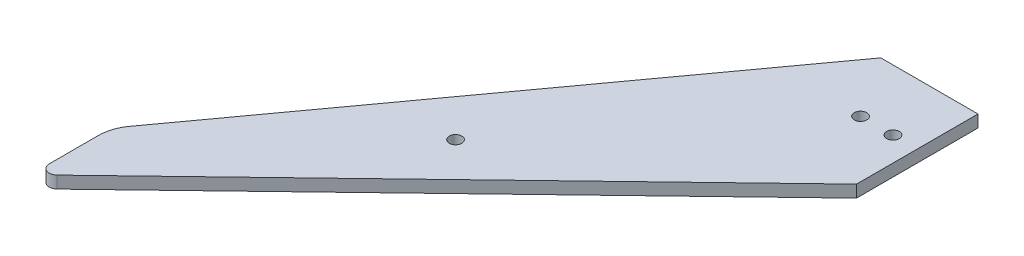
ISO-10303-21;
HEADER;
FILE_DESCRIPTION(('STEP AP214'),'2;1');
FILE_NAME('part.step','',(''),(''),'','','');
FILE_SCHEMA(('AUTOMOTIVE_DESIGN { 1 0 10303 214 1 1 1 1 }'));
ENDSEC;
DATA;
#1=APPLICATION_CONTEXT('core data for automotive mechanical design processes');
#2=APPLICATION_PROTOCOL_DEFINITION('international standard','automotive_design',2000,#1);
#3=PRODUCT_CONTEXT('',#1,'mechanical');
#4=PRODUCT('Part','Part','',(#3));
#5=PRODUCT_RELATED_PRODUCT_CATEGORY('part','',(#4));
#6=PRODUCT_DEFINITION_FORMATION('','',#4);
#7=PRODUCT_DEFINITION_CONTEXT('part definition',#1,'design');
#8=PRODUCT_DEFINITION('design','',#6,#7);
#9=PRODUCT_DEFINITION_SHAPE('','',#8);
#10=(LENGTH_UNIT() NAMED_UNIT(*) SI_UNIT(.MILLI.,.METRE.));
#11=(NAMED_UNIT(*) PLANE_ANGLE_UNIT() SI_UNIT($,.RADIAN.));
#12=(NAMED_UNIT(*) SI_UNIT($,.STERADIAN.) SOLID_ANGLE_UNIT());
#13=UNCERTAINTY_MEASURE_WITH_UNIT(LENGTH_MEASURE(1.E-05),#10,'distance_accuracy_value','');
#14=(GEOMETRIC_REPRESENTATION_CONTEXT(3) GLOBAL_UNCERTAINTY_ASSIGNED_CONTEXT((#13)) GLOBAL_UNIT_ASSIGNED_CONTEXT((#10,
#11,#12)) REPRESENTATION_CONTEXT('',''));
#15=CARTESIAN_POINT('',(0.,0.,0.));
#16=DIRECTION('',(0.,0.,1.));
#17=DIRECTION('',(1.,0.,0.));
#18=AXIS2_PLACEMENT_3D('',#15,#16,#17);
#19=CARTESIAN_POINT('',(13.2590315142198,1.5,13.7893927747886));
#20=DIRECTION('',(-0.693108716251784,0.,-0.720833064901856));
#21=DIRECTION('',(-0.720833064901856,0.,0.693108716251784));
#22=AXIS2_PLACEMENT_3D('',#19,#20,#21);
#23=PLANE('',#22);
#24=DIRECTION('',(0.720833064901856,0.,-0.693108716251785));
#25=VECTOR('',#24,1.);
#26=CARTESIAN_POINT('',(13.2590315142198,1.5,13.7893927747886));
#27=LINE('',#26,#25);
#28=CARTESIAN_POINT('',(-88.6137825674964,1.5,111.744021699516));
#29=VERTEX_POINT('',#28);
#30=CARTESIAN_POINT('',(12.,1.5,15.));
#31=VERTEX_POINT('',#30);
#32=EDGE_CURVE('E98',#29,#31,#27,.T.);
#33=ORIENTED_EDGE('',*,*,#32,.F.);
#34=DIRECTION('',(0.,-1.,0.));
#35=VECTOR('',#34,1.);
#36=CARTESIAN_POINT('',(-88.6137825674964,1.5,111.744021699516));
#37=LINE('',#36,#35);
#38=CARTESIAN_POINT('',(-88.6137825674964,-1.5,111.744021699516));
#39=VERTEX_POINT('',#38);
#40=EDGE_CURVE('E144',#29,#39,#37,.T.);
#41=ORIENTED_EDGE('',*,*,#40,.T.);
#42=DIRECTION('',(0.720833064901856,0.,-0.693108716251785));
#43=VECTOR('',#42,1.);
#44=CARTESIAN_POINT('',(13.2590315142198,-1.5,13.7893927747886));
#45=LINE('',#44,#43);
#46=CARTESIAN_POINT('',(12.,-1.5,15.));
#47=VERTEX_POINT('',#46);
#48=EDGE_CURVE('E122',#39,#47,#45,.T.);
#49=ORIENTED_EDGE('',*,*,#48,.T.);
#50=DIRECTION('',(0.,-1.,0.));
#51=VECTOR('',#50,1.);
#52=CARTESIAN_POINT('',(12.,1.5,15.));
#53=LINE('',#52,#51);
#54=EDGE_CURVE('E116',#31,#47,#53,.T.);
#55=ORIENTED_EDGE('',*,*,#54,.F.);
#56=EDGE_LOOP('',(#33,#41,#49,#55));
#57=FACE_BOUND('',#56,.T.);
#58=ADVANCED_FACE('F39',(#57),#23,.F.);
#59=CARTESIAN_POINT('',(12.,1.5,0.));
#60=DIRECTION('',(-1.,0.,0.));
#61=DIRECTION('',(0.,0.,1.));
#62=AXIS2_PLACEMENT_3D('',#59,#60,#61);
#63=PLANE('',#62);
#64=DIRECTION('',(0.,0.,-1.));
#65=VECTOR('',#64,1.);
#66=CARTESIAN_POINT('',(12.,-1.5,0.));
#67=LINE('',#66,#65);
#68=CARTESIAN_POINT('',(12.,-1.5,-15.));
#69=VERTEX_POINT('',#68);
#70=EDGE_CURVE('E152',#47,#69,#67,.T.);
#71=ORIENTED_EDGE('',*,*,#70,.T.);
#72=DIRECTION('',(0.,-1.,0.));
#73=VECTOR('',#72,1.);
#74=CARTESIAN_POINT('',(12.,1.5,-15.));
#75=LINE('',#74,#73);
#76=CARTESIAN_POINT('',(12.,1.5,-15.));
#77=VERTEX_POINT('',#76);
#78=EDGE_CURVE('E117',#77,#69,#75,.T.);
#79=ORIENTED_EDGE('',*,*,#78,.F.);
#80=DIRECTION('',(0.,0.,-1.));
#81=VECTOR('',#80,1.);
#82=CARTESIAN_POINT('',(12.,1.5,0.));
#83=LINE('',#82,#81);
#84=EDGE_CURVE('E102',#31,#77,#83,.T.);
#85=ORIENTED_EDGE('',*,*,#84,.F.);
#86=ORIENTED_EDGE('',*,*,#54,.T.);
#87=EDGE_LOOP('',(#71,#79,#85,#86));
#88=FACE_BOUND('',#87,.T.);
#89=ADVANCED_FACE('F115',(#88),#63,.F.);
#90=CARTESIAN_POINT('',(0.,1.5,-15.));
#91=DIRECTION('',(0.,0.,-1.));
#92=DIRECTION('',(-1.,0.,0.));
#93=AXIS2_PLACEMENT_3D('',#90,#91,#92);
#94=PLANE('',#93);
#95=DIRECTION('',(1.,0.,0.));
#96=VECTOR('',#95,1.);
#97=CARTESIAN_POINT('',(0.,-1.5,-15.));
#98=LINE('',#97,#96);
#99=CARTESIAN_POINT('',(-12.,-1.5,-15.));
#100=VERTEX_POINT('',#99);
#101=EDGE_CURVE('E158',#100,#69,#98,.T.);
#102=ORIENTED_EDGE('',*,*,#101,.F.);
#103=DIRECTION('',(0.,-1.,0.));
#104=VECTOR('',#103,1.);
#105=CARTESIAN_POINT('',(-12.,1.5,-15.));
#106=LINE('',#105,#104);
#107=CARTESIAN_POINT('',(-12.,1.5,-15.));
#108=VERTEX_POINT('',#107);
#109=EDGE_CURVE('E132',#108,#100,#106,.T.);
#110=ORIENTED_EDGE('',*,*,#109,.F.);
#111=DIRECTION('',(1.,0.,0.));
#112=VECTOR('',#111,1.);
#113=CARTESIAN_POINT('',(0.,1.5,-15.));
#114=LINE('',#113,#112);
#115=EDGE_CURVE('E120',#108,#77,#114,.T.);
#116=ORIENTED_EDGE('',*,*,#115,.T.);
#117=ORIENTED_EDGE('',*,*,#78,.T.);
#118=EDGE_LOOP('',(#102,#110,#116,#117));
#119=FACE_BOUND('',#118,.T.);
#120=ADVANCED_FACE('F234',(#119),#94,.T.);
#121=CARTESIAN_POINT('',(-14.9837837837838,1.5,-10.8972972972973));
#122=DIRECTION('',(0.808736084303189,0.,0.588171697675046));
#123=DIRECTION('',(0.588171697675046,0.,-0.808736084303188));
#124=AXIS2_PLACEMENT_3D('',#121,#122,#123);
#125=PLANE('',#124);
#126=DIRECTION('',(-0.588171697675046,0.,0.808736084303188));
#127=VECTOR('',#126,1.);
#128=CARTESIAN_POINT('',(-14.9837837837838,-1.5,-10.8972972972973));
#129=LINE('',#128,#127);
#130=CARTESIAN_POINT('',(-90.0873608430319,-1.5,92.3701211591688));
#131=VERTEX_POINT('',#130);
#132=EDGE_CURVE('E169',#100,#131,#129,.T.);
#133=ORIENTED_EDGE('',*,*,#132,.T.);
#134=DIRECTION('',(0.,-1.,0.));
#135=VECTOR('',#134,1.);
#136=CARTESIAN_POINT('',(-90.0873608430319,1.5,92.3701211591688));
#137=LINE('',#136,#135);
#138=CARTESIAN_POINT('',(-90.0873608430319,1.5,92.3701211591688));
#139=VERTEX_POINT('',#138);
#140=EDGE_CURVE('E138',#131,#139,#137,.F.);
#141=ORIENTED_EDGE('',*,*,#140,.T.);
#142=DIRECTION('',(-0.588171697675046,0.,0.808736084303188));
#143=VECTOR('',#142,1.);
#144=CARTESIAN_POINT('',(-14.9837837837838,1.5,-10.8972972972973));
#145=LINE('',#144,#143);
#146=EDGE_CURVE('E179',#108,#139,#145,.T.);
#147=ORIENTED_EDGE('',*,*,#146,.F.);
#148=ORIENTED_EDGE('',*,*,#109,.T.);
#149=EDGE_LOOP('',(#133,#141,#147,#148));
#150=FACE_BOUND('',#149,.T.);
#151=ADVANCED_FACE('F249',(#150),#125,.F.);
#152=CARTESIAN_POINT('',(-92.0000000000001,1.5,0.));
#153=DIRECTION('',(1.,0.,0.));
#154=DIRECTION('',(0.,0.,-1.));
#155=AXIS2_PLACEMENT_3D('',#152,#153,#154);
#156=PLANE('',#155);
#157=DIRECTION('',(0.,0.,1.));
#158=VECTOR('',#157,1.);
#159=CARTESIAN_POINT('',(-92.0000000000001,-1.5,0.));
#160=LINE('',#159,#158);
#161=CARTESIAN_POINT('',(-92.,-1.5,98.2518381359193));
#162=VERTEX_POINT('',#161);
#163=CARTESIAN_POINT('',(-92.,-1.5,110.302355569712));
#164=VERTEX_POINT('',#163);
#165=EDGE_CURVE('E110',#162,#164,#160,.T.);
#166=ORIENTED_EDGE('',*,*,#165,.T.);
#167=DIRECTION('',(0.,-1.,0.));
#168=VECTOR('',#167,1.);
#169=CARTESIAN_POINT('',(-92.,1.5,110.302355569712));
#170=LINE('',#169,#168);
#171=CARTESIAN_POINT('',(-92.,1.5,110.302355569712));
#172=VERTEX_POINT('',#171);
#173=EDGE_CURVE('E48',#164,#172,#170,.F.);
#174=ORIENTED_EDGE('',*,*,#173,.T.);
#175=DIRECTION('',(0.,0.,1.));
#176=VECTOR('',#175,1.);
#177=CARTESIAN_POINT('',(-92.0000000000001,1.5,0.));
#178=LINE('',#177,#176);
#179=CARTESIAN_POINT('',(-92.,1.5,98.2518381359193));
#180=VERTEX_POINT('',#179);
#181=EDGE_CURVE('E164',#180,#172,#178,.T.);
#182=ORIENTED_EDGE('',*,*,#181,.F.);
#183=DIRECTION('',(0.,-1.,0.));
#184=VECTOR('',#183,1.);
#185=CARTESIAN_POINT('',(-92.,1.5,98.2518381359193));
#186=LINE('',#185,#184);
#187=EDGE_CURVE('E125',#180,#162,#186,.T.);
#188=ORIENTED_EDGE('',*,*,#187,.T.);
#189=EDGE_LOOP('',(#166,#174,#182,#188));
#190=FACE_BOUND('',#189,.T.);
#191=ADVANCED_FACE('F210',(#190),#156,.F.);
#192=CARTESIAN_POINT('',(0.,1.5,0.));
#193=DIRECTION('',(0.,1.,0.));
#194=DIRECTION('',(0.,0.,1.));
#195=AXIS2_PLACEMENT_3D('',#192,#193,#194);
#196=PLANE('',#195);
#197=CARTESIAN_POINT('',(6.,1.5,0.));
#198=DIRECTION('',(0.,1.,0.));
#199=DIRECTION('',(0.,0.,1.));
#200=AXIS2_PLACEMENT_3D('',#197,#198,#199);
#201=CIRCLE('',#200,1.55);
#202=CARTESIAN_POINT('',(6.,1.5,1.55));
#203=VERTEX_POINT('',#202);
#204=EDGE_CURVE('E161',#203,#203,#201,.T.);
#205=ORIENTED_EDGE('',*,*,#204,.F.);
#206=EDGE_LOOP('',(#205));
#207=FACE_BOUND('',#206,.T.);
#208=CARTESIAN_POINT('',(-2.,1.5,0.));
#209=DIRECTION('',(0.,1.,0.));
#210=DIRECTION('',(0.,0.,1.));
#211=AXIS2_PLACEMENT_3D('',#208,#209,#210);
#212=CIRCLE('',#211,1.55);
#213=CARTESIAN_POINT('',(-2.,1.5,1.55));
#214=VERTEX_POINT('',#213);
#215=EDGE_CURVE('E190',#214,#214,#212,.T.);
#216=ORIENTED_EDGE('',*,*,#215,.F.);
#217=EDGE_LOOP('',(#216));
#218=FACE_BOUND('',#217,.T.);
#219=CARTESIAN_POINT('',(-47.,1.5,55.));
#220=DIRECTION('',(0.,1.,0.));
#221=DIRECTION('',(0.,0.,1.));
#222=AXIS2_PLACEMENT_3D('',#219,#220,#221);
#223=CIRCLE('',#222,1.55);
#224=CARTESIAN_POINT('',(-47.,1.5,56.55));
#225=VERTEX_POINT('',#224);
#226=EDGE_CURVE('E191',#225,#225,#223,.T.);
#227=ORIENTED_EDGE('',*,*,#226,.F.);
#228=EDGE_LOOP('',(#227));
#229=FACE_BOUND('',#228,.T.);
#230=ORIENTED_EDGE('',*,*,#181,.T.);
#231=CARTESIAN_POINT('',(-90.,1.5,110.302355569712));
#232=DIRECTION('',(0.,1.,0.));
#233=DIRECTION('',(0.,0.,1.));
#234=AXIS2_PLACEMENT_3D('',#231,#232,#233);
#235=CIRCLE('',#234,2.);
#236=EDGE_CURVE('E11',#172,#29,#235,.T.);
#237=ORIENTED_EDGE('',*,*,#236,.T.);
#238=ORIENTED_EDGE('',*,*,#32,.T.);
#239=ORIENTED_EDGE('',*,*,#84,.T.);
#240=ORIENTED_EDGE('',*,*,#115,.F.);
#241=ORIENTED_EDGE('',*,*,#146,.T.);
#242=CARTESIAN_POINT('',(-82.,1.5,98.2518381359193));
#243=DIRECTION('',(0.,1.,0.));
#244=DIRECTION('',(0.,0.,1.));
#245=AXIS2_PLACEMENT_3D('',#242,#243,#244);
#246=CIRCLE('',#245,10.);
#247=EDGE_CURVE('E141',#139,#180,#246,.T.);
#248=ORIENTED_EDGE('',*,*,#247,.T.);
#249=EDGE_LOOP('',(#230,#237,#238,#239,#240,#241,#248));
#250=FACE_BOUND('',#249,.T.);
#251=ADVANCED_FACE('F100',(#207,#218,#229,#250),#196,.T.);
#252=CARTESIAN_POINT('',(0.,-1.5,0.));
#253=DIRECTION('',(0.,1.,0.));
#254=DIRECTION('',(0.,0.,1.));
#255=AXIS2_PLACEMENT_3D('',#252,#253,#254);
#256=PLANE('',#255);
#257=CARTESIAN_POINT('',(6.,-1.5,0.));
#258=DIRECTION('',(0.,1.,0.));
#259=DIRECTION('',(0.,0.,1.));
#260=AXIS2_PLACEMENT_3D('',#257,#258,#259);
#261=CIRCLE('',#260,1.55);
#262=CARTESIAN_POINT('',(6.,-1.5,1.55));
#263=VERTEX_POINT('',#262);
#264=EDGE_CURVE('E154',#263,#263,#261,.F.);
#265=ORIENTED_EDGE('',*,*,#264,.F.);
#266=EDGE_LOOP('',(#265));
#267=FACE_BOUND('',#266,.T.);
#268=CARTESIAN_POINT('',(-2.,-1.5,0.));
#269=DIRECTION('',(0.,1.,0.));
#270=DIRECTION('',(0.,0.,1.));
#271=AXIS2_PLACEMENT_3D('',#268,#269,#270);
#272=CIRCLE('',#271,1.55);
#273=CARTESIAN_POINT('',(-2.,-1.5,1.55));
#274=VERTEX_POINT('',#273);
#275=EDGE_CURVE('E195',#274,#274,#272,.F.);
#276=ORIENTED_EDGE('',*,*,#275,.F.);
#277=EDGE_LOOP('',(#276));
#278=FACE_BOUND('',#277,.T.);
#279=CARTESIAN_POINT('',(-47.,-1.5,55.));
#280=DIRECTION('',(0.,1.,0.));
#281=DIRECTION('',(0.,0.,1.));
#282=AXIS2_PLACEMENT_3D('',#279,#280,#281);
#283=CIRCLE('',#282,1.55);
#284=CARTESIAN_POINT('',(-47.,-1.5,56.55));
#285=VERTEX_POINT('',#284);
#286=EDGE_CURVE('E186',#285,#285,#283,.F.);
#287=ORIENTED_EDGE('',*,*,#286,.F.);
#288=EDGE_LOOP('',(#287));
#289=FACE_BOUND('',#288,.T.);
#290=ORIENTED_EDGE('',*,*,#48,.F.);
#291=CARTESIAN_POINT('',(-90.,-1.5,110.302355569712));
#292=DIRECTION('',(0.,1.,0.));
#293=DIRECTION('',(0.,0.,1.));
#294=AXIS2_PLACEMENT_3D('',#291,#292,#293);
#295=CIRCLE('',#294,2.);
#296=EDGE_CURVE('E62',#39,#164,#295,.F.);
#297=ORIENTED_EDGE('',*,*,#296,.T.);
#298=ORIENTED_EDGE('',*,*,#165,.F.);
#299=CARTESIAN_POINT('',(-82.,-1.5,98.2518381359193));
#300=DIRECTION('',(0.,1.,0.));
#301=DIRECTION('',(0.,0.,1.));
#302=AXIS2_PLACEMENT_3D('',#299,#300,#301);
#303=CIRCLE('',#302,10.);
#304=EDGE_CURVE('E130',#162,#131,#303,.F.);
#305=ORIENTED_EDGE('',*,*,#304,.T.);
#306=ORIENTED_EDGE('',*,*,#132,.F.);
#307=ORIENTED_EDGE('',*,*,#101,.T.);
#308=ORIENTED_EDGE('',*,*,#70,.F.);
#309=EDGE_LOOP('',(#290,#297,#298,#305,#306,#307,#308));
#310=FACE_BOUND('',#309,.T.);
#311=ADVANCED_FACE('F150',(#267,#278,#289,#310),#256,.F.);
#312=CARTESIAN_POINT('',(-47.,-5.8840620433566,55.));
#313=DIRECTION('',(0.,1.,0.));
#314=DIRECTION('',(0.,0.,1.));
#315=AXIS2_PLACEMENT_3D('',#312,#313,#314);
#316=CYLINDRICAL_SURFACE('',#315,1.55);
#317=ORIENTED_EDGE('',*,*,#286,.T.);
#318=EDGE_LOOP('',(#317));
#319=FACE_BOUND('',#318,.T.);
#320=ORIENTED_EDGE('',*,*,#226,.T.);
#321=EDGE_LOOP('',(#320));
#322=FACE_BOUND('',#321,.T.);
#323=ADVANCED_FACE('F216',(#319,#322),#316,.F.);
#324=CARTESIAN_POINT('',(-2.,-5.8840620433566,0.));
#325=DIRECTION('',(0.,1.,0.));
#326=DIRECTION('',(0.,0.,1.));
#327=AXIS2_PLACEMENT_3D('',#324,#325,#326);
#328=CYLINDRICAL_SURFACE('',#327,1.55);
#329=ORIENTED_EDGE('',*,*,#275,.T.);
#330=EDGE_LOOP('',(#329));
#331=FACE_BOUND('',#330,.T.);
#332=ORIENTED_EDGE('',*,*,#215,.T.);
#333=EDGE_LOOP('',(#332));
#334=FACE_BOUND('',#333,.T.);
#335=ADVANCED_FACE('F218',(#331,#334),#328,.F.);
#336=CARTESIAN_POINT('',(6.,-5.8840620433566,0.));
#337=DIRECTION('',(0.,1.,0.));
#338=DIRECTION('',(0.,0.,1.));
#339=AXIS2_PLACEMENT_3D('',#336,#337,#338);
#340=CYLINDRICAL_SURFACE('',#339,1.55);
#341=ORIENTED_EDGE('',*,*,#264,.T.);
#342=EDGE_LOOP('',(#341));
#343=FACE_BOUND('',#342,.T.);
#344=ORIENTED_EDGE('',*,*,#204,.T.);
#345=EDGE_LOOP('',(#344));
#346=FACE_BOUND('',#345,.T.);
#347=ADVANCED_FACE('F206',(#343,#346),#340,.F.);
#348=CARTESIAN_POINT('',(-82.,1.5,98.2518381359193));
#349=DIRECTION('',(0.,-1.,0.));
#350=DIRECTION('',(0.,0.,-1.));
#351=AXIS2_PLACEMENT_3D('',#348,#349,#350);
#352=CYLINDRICAL_SURFACE('',#351,10.);
#353=ORIENTED_EDGE('',*,*,#247,.F.);
#354=ORIENTED_EDGE('',*,*,#140,.F.);
#355=ORIENTED_EDGE('',*,*,#304,.F.);
#356=ORIENTED_EDGE('',*,*,#187,.F.);
#357=EDGE_LOOP('',(#353,#354,#355,#356));
#358=FACE_BOUND('',#357,.T.);
#359=ADVANCED_FACE('F237',(#358),#352,.T.);
#360=CARTESIAN_POINT('',(-90.,1.5,110.302355569712));
#361=DIRECTION('',(0.,-1.,0.));
#362=DIRECTION('',(0.,0.,-1.));
#363=AXIS2_PLACEMENT_3D('',#360,#361,#362);
#364=CYLINDRICAL_SURFACE('',#363,2.);
#365=ORIENTED_EDGE('',*,*,#236,.F.);
#366=ORIENTED_EDGE('',*,*,#173,.F.);
#367=ORIENTED_EDGE('',*,*,#296,.F.);
#368=ORIENTED_EDGE('',*,*,#40,.F.);
#369=EDGE_LOOP('',(#365,#366,#367,#368));
#370=FACE_BOUND('',#369,.T.);
#371=ADVANCED_FACE('F41',(#370),#364,.T.);
#372=CLOSED_SHELL('',(#58,#89,#120,#151,#191,#251,#311,#323,#335,#347,#359,#371));
#373=MANIFOLD_SOLID_BREP('B2',#372);
#374=ADVANCED_BREP_SHAPE_REPRESENTATION('',(#18,#373),#14);
#375=SHAPE_DEFINITION_REPRESENTATION(#9,#374);
ENDSEC;
END-ISO-10303-21;
